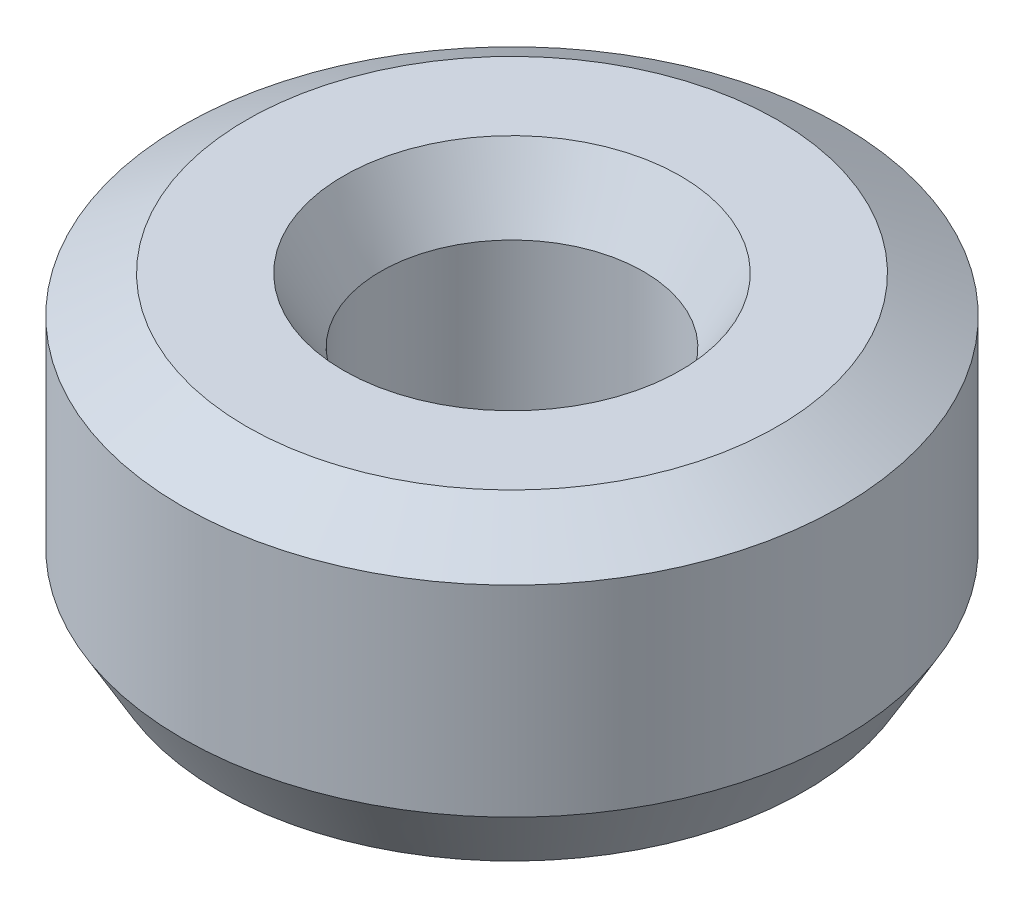
ISO-10303-21;
HEADER;
FILE_DESCRIPTION(('STEP AP214'),'2;1');
FILE_NAME('part.step','',(''),(''),'','','');
FILE_SCHEMA(('AUTOMOTIVE_DESIGN { 1 0 10303 214 1 1 1 1 }'));
ENDSEC;
DATA;
#1=APPLICATION_CONTEXT('core data for automotive mechanical design processes');
#2=APPLICATION_PROTOCOL_DEFINITION('international standard','automotive_design',2000,#1);
#3=PRODUCT_CONTEXT('',#1,'mechanical');
#4=PRODUCT('Part','Part','',(#3));
#5=PRODUCT_RELATED_PRODUCT_CATEGORY('part','',(#4));
#6=PRODUCT_DEFINITION_FORMATION('','',#4);
#7=PRODUCT_DEFINITION_CONTEXT('part definition',#1,'design');
#8=PRODUCT_DEFINITION('design','',#6,#7);
#9=PRODUCT_DEFINITION_SHAPE('','',#8);
#10=(LENGTH_UNIT() NAMED_UNIT(*) SI_UNIT(.MILLI.,.METRE.));
#11=(NAMED_UNIT(*) PLANE_ANGLE_UNIT() SI_UNIT($,.RADIAN.));
#12=(NAMED_UNIT(*) SI_UNIT($,.STERADIAN.) SOLID_ANGLE_UNIT());
#13=UNCERTAINTY_MEASURE_WITH_UNIT(LENGTH_MEASURE(1.E-05),#10,'distance_accuracy_value','');
#14=(GEOMETRIC_REPRESENTATION_CONTEXT(3) GLOBAL_UNCERTAINTY_ASSIGNED_CONTEXT((#13)) GLOBAL_UNIT_ASSIGNED_CONTEXT((#10,
#11,#12)) REPRESENTATION_CONTEXT('',''));
#15=CARTESIAN_POINT('',(0.,0.,0.));
#16=DIRECTION('',(0.,0.,1.));
#17=DIRECTION('',(1.,0.,0.));
#18=AXIS2_PLACEMENT_3D('',#15,#16,#17);
#19=CARTESIAN_POINT('',(0.,32.0799709650828,0.));
#20=DIRECTION('',(0.,-1.,0.));
#21=DIRECTION('',(0.,0.,-1.));
#22=AXIS2_PLACEMENT_3D('',#19,#20,#21);
#23=CYLINDRICAL_SURFACE('',#22,35.);
#24=CARTESIAN_POINT('',(0.,6.81200583742755,0.));
#25=DIRECTION('',(0.,1.,0.));
#26=DIRECTION('',(0.,0.,1.));
#27=AXIS2_PLACEMENT_3D('',#24,#25,#26);
#28=CIRCLE('',#27,35.);
#29=CARTESIAN_POINT('',(0.,6.81200583742755,35.));
#30=VERTEX_POINT('',#29);
#31=EDGE_CURVE('E10',#30,#30,#28,.T.);
#32=ORIENTED_EDGE('',*,*,#31,.T.);
#33=EDGE_LOOP('',(#32));
#34=FACE_BOUND('',#33,.T.);
#35=CARTESIAN_POINT('',(0.,28.1470575611227,0.));
#36=DIRECTION('',(0.,1.,0.));
#37=DIRECTION('',(0.,0.,1.));
#38=AXIS2_PLACEMENT_3D('',#35,#36,#37);
#39=CIRCLE('',#38,35.);
#40=CARTESIAN_POINT('',(0.,28.1470575611227,35.));
#41=VERTEX_POINT('',#40);
#42=EDGE_CURVE('E50',#41,#41,#39,.F.);
#43=ORIENTED_EDGE('',*,*,#42,.T.);
#44=EDGE_LOOP('',(#43));
#45=FACE_BOUND('',#44,.T.);
#46=ADVANCED_FACE('F39',(#34,#45),#23,.T.);
#47=CARTESIAN_POINT('',(0.,32.0799709650828,0.));
#48=DIRECTION('',(0.,1.,0.));
#49=DIRECTION('',(0.,0.,1.));
#50=AXIS2_PLACEMENT_3D('',#47,#48,#49);
#51=PLANE('',#50);
#52=CARTESIAN_POINT('',(0.,32.0799709650828,0.));
#53=DIRECTION('',(0.,1.,0.));
#54=DIRECTION('',(0.,0.,1.));
#55=AXIS2_PLACEMENT_3D('',#52,#53,#54);
#56=CIRCLE('',#55,17.8877789426879);
#57=CARTESIAN_POINT('',(0.,32.0799709650828,17.8877789426879));
#58=VERTEX_POINT('',#57);
#59=EDGE_CURVE('E58',#58,#58,#56,.F.);
#60=ORIENTED_EDGE('',*,*,#59,.T.);
#61=EDGE_LOOP('',(#60));
#62=FACE_BOUND('',#61,.T.);
#63=CARTESIAN_POINT('',(0.,32.0799709650828,0.));
#64=DIRECTION('',(0.,1.,0.));
#65=DIRECTION('',(0.,0.,1.));
#66=AXIS2_PLACEMENT_3D('',#63,#64,#65);
#67=CIRCLE('',#66,28.1879941625725);
#68=CARTESIAN_POINT('',(0.,32.0799709650828,28.1879941625725));
#69=VERTEX_POINT('',#68);
#70=EDGE_CURVE('E61',#69,#69,#67,.T.);
#71=ORIENTED_EDGE('',*,*,#70,.T.);
#72=EDGE_LOOP('',(#71));
#73=FACE_BOUND('',#72,.T.);
#74=ADVANCED_FACE('F88',(#62,#73),#51,.T.);
#75=CARTESIAN_POINT('',(0.,0.,0.));
#76=DIRECTION('',(0.,1.,0.));
#77=DIRECTION('',(0.,0.,1.));
#78=AXIS2_PLACEMENT_3D('',#75,#76,#77);
#79=PLANE('',#78);
#80=CARTESIAN_POINT('',(0.,0.,0.));
#81=DIRECTION('',(0.,1.,0.));
#82=DIRECTION('',(0.,0.,1.));
#83=AXIS2_PLACEMENT_3D('',#80,#81,#82);
#84=CIRCLE('',#83,20.7668713761553);
#85=CARTESIAN_POINT('',(0.,0.,20.7668713761553));
#86=VERTEX_POINT('',#85);
#87=EDGE_CURVE('E51',#86,#86,#84,.T.);
#88=ORIENTED_EDGE('',*,*,#87,.T.);
#89=EDGE_LOOP('',(#88));
#90=FACE_BOUND('',#89,.T.);
#91=CARTESIAN_POINT('',(0.,0.,0.));
#92=DIRECTION('',(0.,1.,0.));
#93=DIRECTION('',(0.,0.,1.));
#94=AXIS2_PLACEMENT_3D('',#91,#92,#93);
#95=CIRCLE('',#94,31.0670865960399);
#96=CARTESIAN_POINT('',(0.,0.,31.0670865960399));
#97=VERTEX_POINT('',#96);
#98=EDGE_CURVE('E54',#97,#97,#95,.F.);
#99=ORIENTED_EDGE('',*,*,#98,.T.);
#100=EDGE_LOOP('',(#99));
#101=FACE_BOUND('',#100,.T.);
#102=ADVANCED_FACE('F83',(#90,#101),#79,.F.);
#103=CARTESIAN_POINT('',(0.,32.0799709650828,0.));
#104=DIRECTION('',(0.,-1.,0.));
#105=DIRECTION('',(0.,0.,-1.));
#106=AXIS2_PLACEMENT_3D('',#103,#104,#105);
#107=CYLINDRICAL_SURFACE('',#106,13.9548655387277);
#108=CARTESIAN_POINT('',(0.,25.2679651276553,0.));
#109=DIRECTION('',(0.,1.,0.));
#110=DIRECTION('',(0.,0.,1.));
#111=AXIS2_PLACEMENT_3D('',#108,#109,#110);
#112=CIRCLE('',#111,13.9548655387277);
#113=CARTESIAN_POINT('',(0.,25.2679651276553,13.9548655387277));
#114=VERTEX_POINT('',#113);
#115=EDGE_CURVE('E67',#114,#114,#112,.T.);
#116=ORIENTED_EDGE('',*,*,#115,.T.);
#117=EDGE_LOOP('',(#116));
#118=FACE_BOUND('',#117,.T.);
#119=CARTESIAN_POINT('',(0.,3.93291340396013,0.));
#120=DIRECTION('',(0.,1.,0.));
#121=DIRECTION('',(0.,0.,1.));
#122=AXIS2_PLACEMENT_3D('',#119,#120,#121);
#123=CIRCLE('',#122,13.9548655387277);
#124=CARTESIAN_POINT('',(0.,3.93291340396013,13.9548655387277));
#125=VERTEX_POINT('',#124);
#126=EDGE_CURVE('E69',#125,#125,#123,.F.);
#127=ORIENTED_EDGE('',*,*,#126,.T.);
#128=EDGE_LOOP('',(#127));
#129=FACE_BOUND('',#128,.T.);
#130=ADVANCED_FACE('F71',(#118,#129),#107,.F.);
#131=CARTESIAN_POINT('',(0.,25.2679651276553,0.));
#132=DIRECTION('',(0.,1.,0.));
#133=DIRECTION('',(0.,0.,1.));
#134=AXIS2_PLACEMENT_3D('',#131,#132,#133);
#135=CONICAL_SURFACE('',#134,13.9548655387277,0.523598775598302);
#136=CARTESIAN_POINT('',(0.,32.0799709650828,17.8877789426879));
#137=CARTESIAN_POINT('',(0.,32.0090125709429,17.8468110947299));
#138=CARTESIAN_POINT('',(0.,31.9380541768031,17.805843246772));
#139=CARTESIAN_POINT('',(0.,31.7961373885233,17.7239075508562));
#140=CARTESIAN_POINT('',(0.,31.7251789943835,17.6829397028983));
#141=CARTESIAN_POINT('',(0.,31.5832622061037,17.6010040069824));
#142=CARTESIAN_POINT('',(0.,31.5123038119639,17.5600361590245));
#143=CARTESIAN_POINT('',(0.,31.3703870236841,17.4781004631087));
#144=CARTESIAN_POINT('',(0.,31.2994286295442,17.4371326151508));
#145=CARTESIAN_POINT('',(0.,31.1575118412645,17.3551969192349));
#146=CARTESIAN_POINT('',(0.,31.0865534471246,17.314229071277));
#147=CARTESIAN_POINT('',(0.,30.9446366588449,17.2322933753612));
#148=CARTESIAN_POINT('',(0.,30.873678264705,17.1913255274033));
#149=CARTESIAN_POINT('',(0.,30.7317614764253,17.1093898314874));
#150=CARTESIAN_POINT('',(0.,30.6608030822854,17.0684219835295));
#151=CARTESIAN_POINT('',(0.,30.5188862940057,16.9864862876137));
#152=CARTESIAN_POINT('',(0.,30.4479278998658,16.9455184396557));
#153=CARTESIAN_POINT('',(0.,30.3060111115861,16.8635827437399));
#154=CARTESIAN_POINT('',(0.,30.2350527174462,16.822614895782));
#155=CARTESIAN_POINT('',(0.,30.0931359291665,16.7406791998662));
#156=CARTESIAN_POINT('',(0.,30.0221775350266,16.6997113519082));
#157=CARTESIAN_POINT('',(0.,29.8802607467468,16.6177756559924));
#158=CARTESIAN_POINT('',(0.,29.809302352607,16.5768078080345));
#159=CARTESIAN_POINT('',(0.,29.6673855643272,16.4948721121186));
#160=CARTESIAN_POINT('',(0.,29.5964271701874,16.4539042641607));
#161=CARTESIAN_POINT('',(0.,29.4545103819076,16.3719685682449));
#162=CARTESIAN_POINT('',(0.,29.3835519877677,16.331000720287));
#163=CARTESIAN_POINT('',(0.,29.241635199488,16.2490650243711));
#164=CARTESIAN_POINT('',(0.,29.1706768053481,16.2080971764132));
#165=CARTESIAN_POINT('',(0.,29.0287600170684,16.1261614804974));
#166=CARTESIAN_POINT('',(0.,28.9578016229285,16.0851936325395));
#167=CARTESIAN_POINT('',(0.,28.8158848346488,16.0032579366236));
#168=CARTESIAN_POINT('',(0.,28.7449264405089,15.9622900886657));
#169=CARTESIAN_POINT('',(0.,28.6030096522292,15.8803543927499));
#170=CARTESIAN_POINT('',(0.,28.5320512580893,15.839386544792));
#171=CARTESIAN_POINT('',(0.,28.3901344698096,15.7574508488761));
#172=CARTESIAN_POINT('',(0.,28.3191760756697,15.7164830009182));
#173=CARTESIAN_POINT('',(0.,28.17725928739,15.6345473050024));
#174=CARTESIAN_POINT('',(0.,28.1063008932501,15.5935794570445));
#175=CARTESIAN_POINT('',(0.,27.9643841049703,15.5116437611286));
#176=CARTESIAN_POINT('',(0.,27.8934257108305,15.4706759131707));
#177=CARTESIAN_POINT('',(0.,27.7515089225507,15.3887402172549));
#178=CARTESIAN_POINT('',(0.,27.6805505284109,15.3477723692969));
#179=CARTESIAN_POINT('',(0.,27.5386337401311,15.2658366733811));
#180=CARTESIAN_POINT('',(0.,27.4676753459913,15.2248688254232));
#181=CARTESIAN_POINT('',(0.,27.3257585577115,15.1429331295074));
#182=CARTESIAN_POINT('',(0.,27.2548001635716,15.1019652815494));
#183=CARTESIAN_POINT('',(0.,27.1128833752919,15.0200295856336));
#184=CARTESIAN_POINT('',(0.,27.041924981152,14.9790617376757));
#185=CARTESIAN_POINT('',(0.,26.9000081928723,14.8971260417599));
#186=CARTESIAN_POINT('',(0.,26.8290497987324,14.8561581938019));
#187=CARTESIAN_POINT('',(0.,26.6871330104527,14.7742224978861));
#188=CARTESIAN_POINT('',(0.,26.6161746163128,14.7332546499282));
#189=CARTESIAN_POINT('',(0.,26.4742578280331,14.6513189540123));
#190=CARTESIAN_POINT('',(0.,26.4032994338932,14.6103511060544));
#191=CARTESIAN_POINT('',(0.,26.2613826456135,14.5284154101386));
#192=CARTESIAN_POINT('',(0.,26.1904242514736,14.4874475621807));
#193=CARTESIAN_POINT('',(0.,26.0485074631939,14.4055118662648));
#194=CARTESIAN_POINT('',(0.,25.977549069054,14.3645440183069));
#195=CARTESIAN_POINT('',(0.,25.8356322807742,14.2826083223911));
#196=CARTESIAN_POINT('',(0.,25.7646738866344,14.2416404744332));
#197=CARTESIAN_POINT('',(0.,25.6227570983546,14.1597047785173));
#198=CARTESIAN_POINT('',(0.,25.5517987042148,14.1187369305594));
#199=CARTESIAN_POINT('',(0.,25.409881915935,14.0368012346436));
#200=CARTESIAN_POINT('',(0.,25.3389235217952,13.9958333866857));
#201=CARTESIAN_POINT('',(0.,25.2679651276553,13.9548655387277));
#202=B_SPLINE_CURVE_WITH_KNOTS('',3,(#136,#137,#138,#139,#140,#141,#142,#143,#144,#145,#146,
#147,#148,#149,#150,#151,#152,#153,#154,#155,#156,#157,#158,#159,#160,#161,#162,#163,#164,#165,
#166,#167,#168,#169,#170,#171,#172,#173,#174,#175,#176,#177,#178,#179,#180,#181,#182,#183,#184,
#185,#186,#187,#188,#189,#190,#191,#192,#193,#194,#195,#196,#197,#198,#199,#200,#201),
.UNSPECIFIED.,.F.,.F.,(4,2,2,2,2,2,2,2,2,2,2,2,2,2,2,2,2,2,2,2,2,2,2,2,2,2,2,2,2,2,2,2,4),(0.,
0.245807087747505,0.491614175495009,0.737421263242514,0.983228350990021,1.22903543873753,
1.47484252648503,1.72064961423254,1.96645670198004,2.21226378972755,2.45807087747505,
2.70387796522256,2.94968505297007,3.19549214071757,3.44129922846508,3.68710631621258,
3.93291340396009,4.1787204917076,4.4245275794551,4.67033466720261,4.91614175495011,
5.16194884269762,5.40775593044512,5.65356301819263,5.89937010594014,6.14517719368764,
6.39098428143515,6.63679136918266,6.88259845693016,7.12840554467767,7.37421263242517,
7.62001972017268,7.86582680792018),.UNSPECIFIED.);
#203=EDGE_CURVE('BSEAM77',#58,#114,#202,.T.);
#204=ORIENTED_EDGE('',*,*,#59,.F.);
#205=ORIENTED_EDGE('',*,*,#115,.F.);
#206=ORIENTED_EDGE('',*,*,#203,.T.);
#207=ORIENTED_EDGE('',*,*,#203,.F.);
#208=EDGE_LOOP('',(#204,#206,#205,#207));
#209=FACE_BOUND('',#208,.T.);
#210=ADVANCED_FACE('F77',(#209),#135,.F.);
#211=CARTESIAN_POINT('',(0.,0.,0.));
#212=DIRECTION('',(0.,-1.,0.));
#213=DIRECTION('',(0.,0.,-1.));
#214=AXIS2_PLACEMENT_3D('',#211,#212,#213);
#215=CONICAL_SURFACE('',#214,20.7668713761553,1.04719755119659);
#216=ORIENTED_EDGE('',*,*,#126,.F.);
#217=EDGE_LOOP('',(#216));
#218=FACE_BOUND('',#217,.T.);
#219=ORIENTED_EDGE('',*,*,#87,.F.);
#220=EDGE_LOOP('',(#219));
#221=FACE_BOUND('',#220,.T.);
#222=ADVANCED_FACE('F73',(#218,#221),#215,.F.);
#223=CARTESIAN_POINT('',(0.,6.81200583742755,0.));
#224=DIRECTION('',(0.,1.,0.));
#225=DIRECTION('',(0.,0.,1.));
#226=AXIS2_PLACEMENT_3D('',#223,#224,#225);
#227=CONICAL_SURFACE('',#226,35.,0.523598775598302);
#228=ORIENTED_EDGE('',*,*,#98,.F.);
#229=EDGE_LOOP('',(#228));
#230=FACE_BOUND('',#229,.T.);
#231=ORIENTED_EDGE('',*,*,#31,.F.);
#232=EDGE_LOOP('',(#231));
#233=FACE_BOUND('',#232,.T.);
#234=ADVANCED_FACE('F76',(#230,#233),#227,.T.);
#235=CARTESIAN_POINT('',(0.,32.0799709650828,0.));
#236=DIRECTION('',(0.,-1.,0.));
#237=DIRECTION('',(0.,0.,-1.));
#238=AXIS2_PLACEMENT_3D('',#235,#236,#237);
#239=CONICAL_SURFACE('',#238,28.1879941625725,1.04719755119659);
#240=ORIENTED_EDGE('',*,*,#42,.F.);
#241=EDGE_LOOP('',(#240));
#242=FACE_BOUND('',#241,.T.);
#243=ORIENTED_EDGE('',*,*,#70,.F.);
#244=EDGE_LOOP('',(#243));
#245=FACE_BOUND('',#244,.T.);
#246=ADVANCED_FACE('F45',(#242,#245),#239,.T.);
#247=CLOSED_SHELL('',(#46,#74,#102,#130,#210,#222,#234,#246));
#248=MANIFOLD_SOLID_BREP('B2',#247);
#249=ADVANCED_BREP_SHAPE_REPRESENTATION('',(#18,#248),#14);
#250=SHAPE_DEFINITION_REPRESENTATION(#9,#249);
ENDSEC;
END-ISO-10303-21;
